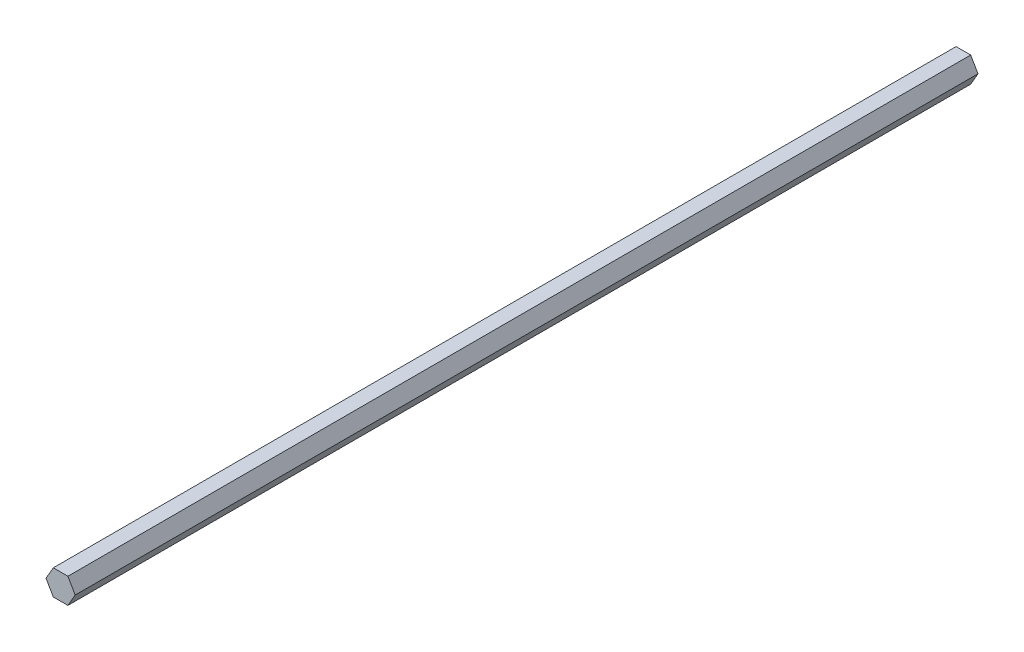
ISO-10303-21;
HEADER;
FILE_DESCRIPTION(('STEP AP214'),'2;1');
FILE_NAME('part.step','',(''),(''),'','','');
FILE_SCHEMA(('AUTOMOTIVE_DESIGN { 1 0 10303 214 1 1 1 1 }'));
ENDSEC;
DATA;
#1=APPLICATION_CONTEXT('core data for automotive mechanical design processes');
#2=APPLICATION_PROTOCOL_DEFINITION('international standard','automotive_design',2000,#1);
#3=PRODUCT_CONTEXT('',#1,'mechanical');
#4=PRODUCT('Part','Part','',(#3));
#5=PRODUCT_RELATED_PRODUCT_CATEGORY('part','',(#4));
#6=PRODUCT_DEFINITION_FORMATION('','',#4);
#7=PRODUCT_DEFINITION_CONTEXT('part definition',#1,'design');
#8=PRODUCT_DEFINITION('design','',#6,#7);
#9=PRODUCT_DEFINITION_SHAPE('','',#8);
#10=(LENGTH_UNIT() NAMED_UNIT(*) SI_UNIT(.MILLI.,.METRE.));
#11=(NAMED_UNIT(*) PLANE_ANGLE_UNIT() SI_UNIT($,.RADIAN.));
#12=(NAMED_UNIT(*) SI_UNIT($,.STERADIAN.) SOLID_ANGLE_UNIT());
#13=UNCERTAINTY_MEASURE_WITH_UNIT(LENGTH_MEASURE(1.E-05),#10,'distance_accuracy_value','');
#14=(GEOMETRIC_REPRESENTATION_CONTEXT(3) GLOBAL_UNCERTAINTY_ASSIGNED_CONTEXT((#13)) GLOBAL_UNIT_ASSIGNED_CONTEXT((#10,
#11,#12)) REPRESENTATION_CONTEXT('',''));
#15=CARTESIAN_POINT('',(0.,0.,0.));
#16=DIRECTION('',(0.,0.,1.));
#17=DIRECTION('',(1.,0.,0.));
#18=AXIS2_PLACEMENT_3D('',#15,#16,#17);
#19=CARTESIAN_POINT('',(3.665,6.34796620973994,453.18));
#20=DIRECTION('',(0.,-1.,0.));
#21=DIRECTION('',(0.,0.,-1.));
#22=AXIS2_PLACEMENT_3D('',#19,#20,#21);
#23=PLANE('',#22);
#24=DIRECTION('',(-1.,0.,0.));
#25=VECTOR('',#24,1.);
#26=CARTESIAN_POINT('',(3.665,6.34796620973994,0.));
#27=LINE('',#26,#25);
#28=CARTESIAN_POINT('',(3.665,6.34796620973994,0.));
#29=VERTEX_POINT('',#28);
#30=CARTESIAN_POINT('',(-3.665,6.34796620973994,0.));
#31=VERTEX_POINT('',#30);
#32=EDGE_CURVE('E118',#29,#31,#27,.T.);
#33=ORIENTED_EDGE('',*,*,#32,.T.);
#34=DIRECTION('',(0.,0.,-1.));
#35=VECTOR('',#34,1.);
#36=CARTESIAN_POINT('',(-3.665,6.34796620973994,453.18));
#37=LINE('',#36,#35);
#38=CARTESIAN_POINT('',(-3.665,6.34796620973994,453.18));
#39=VERTEX_POINT('',#38);
#40=EDGE_CURVE('E11',#39,#31,#37,.T.);
#41=ORIENTED_EDGE('',*,*,#40,.F.);
#42=DIRECTION('',(-1.,0.,0.));
#43=VECTOR('',#42,1.);
#44=CARTESIAN_POINT('',(3.665,6.34796620973994,453.18));
#45=LINE('',#44,#43);
#46=CARTESIAN_POINT('',(3.665,6.34796620973994,453.18));
#47=VERTEX_POINT('',#46);
#48=EDGE_CURVE('E128',#47,#39,#45,.T.);
#49=ORIENTED_EDGE('',*,*,#48,.F.);
#50=DIRECTION('',(0.,0.,-1.));
#51=VECTOR('',#50,1.);
#52=CARTESIAN_POINT('',(3.665,6.34796620973994,453.18));
#53=LINE('',#52,#51);
#54=EDGE_CURVE('E114',#47,#29,#53,.T.);
#55=ORIENTED_EDGE('',*,*,#54,.T.);
#56=EDGE_LOOP('',(#33,#41,#49,#55));
#57=FACE_BOUND('',#56,.T.);
#58=ADVANCED_FACE('F34',(#57),#23,.F.);
#59=CARTESIAN_POINT('',(-3.665,6.34796620973994,453.18));
#60=DIRECTION('',(0.866025403784439,-0.5,0.));
#61=DIRECTION('',(0.5,0.866025403784439,0.));
#62=AXIS2_PLACEMENT_3D('',#59,#60,#61);
#63=PLANE('',#62);
#64=DIRECTION('',(-0.5,-0.866025403784439,0.));
#65=VECTOR('',#64,1.);
#66=CARTESIAN_POINT('',(-3.665,6.34796620973994,0.));
#67=LINE('',#66,#65);
#68=CARTESIAN_POINT('',(-7.33,0.,0.));
#69=VERTEX_POINT('',#68);
#70=EDGE_CURVE('E121',#31,#69,#67,.T.);
#71=ORIENTED_EDGE('',*,*,#70,.T.);
#72=DIRECTION('',(0.,0.,-1.));
#73=VECTOR('',#72,1.);
#74=CARTESIAN_POINT('',(-7.33,0.,453.18));
#75=LINE('',#74,#73);
#76=CARTESIAN_POINT('',(-7.33,0.,453.18));
#77=VERTEX_POINT('',#76);
#78=EDGE_CURVE('E42',#77,#69,#75,.T.);
#79=ORIENTED_EDGE('',*,*,#78,.F.);
#80=DIRECTION('',(-0.5,-0.866025403784439,0.));
#81=VECTOR('',#80,1.);
#82=CARTESIAN_POINT('',(-3.665,6.34796620973994,453.18));
#83=LINE('',#82,#81);
#84=EDGE_CURVE('E87',#39,#77,#83,.T.);
#85=ORIENTED_EDGE('',*,*,#84,.F.);
#86=ORIENTED_EDGE('',*,*,#40,.T.);
#87=EDGE_LOOP('',(#71,#79,#85,#86));
#88=FACE_BOUND('',#87,.T.);
#89=ADVANCED_FACE('F152',(#88),#63,.F.);
#90=CARTESIAN_POINT('',(-7.33,0.,453.18));
#91=DIRECTION('',(0.866025403784439,0.5,0.));
#92=DIRECTION('',(-0.5,0.866025403784439,0.));
#93=AXIS2_PLACEMENT_3D('',#90,#91,#92);
#94=PLANE('',#93);
#95=DIRECTION('',(0.5,-0.866025403784439,0.));
#96=VECTOR('',#95,1.);
#97=CARTESIAN_POINT('',(-7.33,0.,0.));
#98=LINE('',#97,#96);
#99=CARTESIAN_POINT('',(-3.665,-6.34796620973994,0.));
#100=VERTEX_POINT('',#99);
#101=EDGE_CURVE('E123',#69,#100,#98,.T.);
#102=ORIENTED_EDGE('',*,*,#101,.T.);
#103=DIRECTION('',(0.,0.,-1.));
#104=VECTOR('',#103,1.);
#105=CARTESIAN_POINT('',(-3.665,-6.34796620973994,453.18));
#106=LINE('',#105,#104);
#107=CARTESIAN_POINT('',(-3.665,-6.34796620973994,453.18));
#108=VERTEX_POINT('',#107);
#109=EDGE_CURVE('E109',#108,#100,#106,.T.);
#110=ORIENTED_EDGE('',*,*,#109,.F.);
#111=DIRECTION('',(0.5,-0.866025403784439,0.));
#112=VECTOR('',#111,1.);
#113=CARTESIAN_POINT('',(-7.33,0.,453.18));
#114=LINE('',#113,#112);
#115=EDGE_CURVE('E100',#77,#108,#114,.T.);
#116=ORIENTED_EDGE('',*,*,#115,.F.);
#117=ORIENTED_EDGE('',*,*,#78,.T.);
#118=EDGE_LOOP('',(#102,#110,#116,#117));
#119=FACE_BOUND('',#118,.T.);
#120=ADVANCED_FACE('F134',(#119),#94,.F.);
#121=CARTESIAN_POINT('',(-3.665,-6.34796620973994,453.18));
#122=DIRECTION('',(0.,1.,0.));
#123=DIRECTION('',(-1.,0.,0.));
#124=AXIS2_PLACEMENT_3D('',#121,#122,#123);
#125=PLANE('',#124);
#126=DIRECTION('',(1.,0.,0.));
#127=VECTOR('',#126,1.);
#128=CARTESIAN_POINT('',(-3.665,-6.34796620973994,0.));
#129=LINE('',#128,#127);
#130=CARTESIAN_POINT('',(3.665,-6.34796620973994,0.));
#131=VERTEX_POINT('',#130);
#132=EDGE_CURVE('E108',#100,#131,#129,.T.);
#133=ORIENTED_EDGE('',*,*,#132,.T.);
#134=DIRECTION('',(0.,0.,-1.));
#135=VECTOR('',#134,1.);
#136=CARTESIAN_POINT('',(3.665,-6.34796620973994,453.18));
#137=LINE('',#136,#135);
#138=CARTESIAN_POINT('',(3.665,-6.34796620973994,453.18));
#139=VERTEX_POINT('',#138);
#140=EDGE_CURVE('E105',#139,#131,#137,.T.);
#141=ORIENTED_EDGE('',*,*,#140,.F.);
#142=DIRECTION('',(1.,0.,0.));
#143=VECTOR('',#142,1.);
#144=CARTESIAN_POINT('',(-3.665,-6.34796620973994,453.18));
#145=LINE('',#144,#143);
#146=EDGE_CURVE('E94',#108,#139,#145,.T.);
#147=ORIENTED_EDGE('',*,*,#146,.F.);
#148=ORIENTED_EDGE('',*,*,#109,.T.);
#149=EDGE_LOOP('',(#133,#141,#147,#148));
#150=FACE_BOUND('',#149,.T.);
#151=ADVANCED_FACE('F106',(#150),#125,.F.);
#152=CARTESIAN_POINT('',(3.665,-6.34796620973994,453.18));
#153=DIRECTION('',(-0.866025403784439,0.5,0.));
#154=DIRECTION('',(-0.5,-0.866025403784439,0.));
#155=AXIS2_PLACEMENT_3D('',#152,#153,#154);
#156=PLANE('',#155);
#157=DIRECTION('',(0.5,0.866025403784439,0.));
#158=VECTOR('',#157,1.);
#159=CARTESIAN_POINT('',(3.665,-6.34796620973994,0.));
#160=LINE('',#159,#158);
#161=CARTESIAN_POINT('',(7.33,0.,0.));
#162=VERTEX_POINT('',#161);
#163=EDGE_CURVE('E73',#131,#162,#160,.T.);
#164=ORIENTED_EDGE('',*,*,#163,.T.);
#165=DIRECTION('',(0.,0.,-1.));
#166=VECTOR('',#165,1.);
#167=CARTESIAN_POINT('',(7.33,0.,453.18));
#168=LINE('',#167,#166);
#169=CARTESIAN_POINT('',(7.33,0.,453.18));
#170=VERTEX_POINT('',#169);
#171=EDGE_CURVE('E110',#170,#162,#168,.T.);
#172=ORIENTED_EDGE('',*,*,#171,.F.);
#173=DIRECTION('',(0.5,0.866025403784439,0.));
#174=VECTOR('',#173,1.);
#175=CARTESIAN_POINT('',(3.665,-6.34796620973994,453.18));
#176=LINE('',#175,#174);
#177=EDGE_CURVE('E98',#139,#170,#176,.T.);
#178=ORIENTED_EDGE('',*,*,#177,.F.);
#179=ORIENTED_EDGE('',*,*,#140,.T.);
#180=EDGE_LOOP('',(#164,#172,#178,#179));
#181=FACE_BOUND('',#180,.T.);
#182=ADVANCED_FACE('F112',(#181),#156,.F.);
#183=CARTESIAN_POINT('',(7.33,0.,453.18));
#184=DIRECTION('',(-0.866025403784439,-0.5,0.));
#185=DIRECTION('',(0.5,-0.866025403784439,0.));
#186=AXIS2_PLACEMENT_3D('',#183,#184,#185);
#187=PLANE('',#186);
#188=DIRECTION('',(-0.5,0.866025403784439,0.));
#189=VECTOR('',#188,1.);
#190=CARTESIAN_POINT('',(7.33,0.,0.));
#191=LINE('',#190,#189);
#192=EDGE_CURVE('E79',#162,#29,#191,.T.);
#193=ORIENTED_EDGE('',*,*,#192,.T.);
#194=ORIENTED_EDGE('',*,*,#54,.F.);
#195=DIRECTION('',(-0.5,0.866025403784439,0.));
#196=VECTOR('',#195,1.);
#197=CARTESIAN_POINT('',(7.33,0.,453.18));
#198=LINE('',#197,#196);
#199=EDGE_CURVE('E50',#170,#47,#198,.T.);
#200=ORIENTED_EDGE('',*,*,#199,.F.);
#201=ORIENTED_EDGE('',*,*,#171,.T.);
#202=EDGE_LOOP('',(#193,#194,#200,#201));
#203=FACE_BOUND('',#202,.T.);
#204=ADVANCED_FACE('F141',(#203),#187,.F.);
#205=CARTESIAN_POINT('',(0.,0.,453.18));
#206=DIRECTION('',(0.,0.,1.));
#207=DIRECTION('',(1.,0.,0.));
#208=AXIS2_PLACEMENT_3D('',#205,#206,#207);
#209=PLANE('',#208);
#210=ORIENTED_EDGE('',*,*,#48,.T.);
#211=ORIENTED_EDGE('',*,*,#84,.T.);
#212=ORIENTED_EDGE('',*,*,#115,.T.);
#213=ORIENTED_EDGE('',*,*,#146,.T.);
#214=ORIENTED_EDGE('',*,*,#177,.T.);
#215=ORIENTED_EDGE('',*,*,#199,.T.);
#216=EDGE_LOOP('',(#210,#211,#212,#213,#214,#215));
#217=FACE_BOUND('',#216,.T.);
#218=ADVANCED_FACE('F96',(#217),#209,.T.);
#219=CARTESIAN_POINT('',(0.,0.,0.));
#220=DIRECTION('',(0.,0.,1.));
#221=DIRECTION('',(1.,0.,0.));
#222=AXIS2_PLACEMENT_3D('',#219,#220,#221);
#223=PLANE('',#222);
#224=ORIENTED_EDGE('',*,*,#32,.F.);
#225=ORIENTED_EDGE('',*,*,#192,.F.);
#226=ORIENTED_EDGE('',*,*,#163,.F.);
#227=ORIENTED_EDGE('',*,*,#132,.F.);
#228=ORIENTED_EDGE('',*,*,#101,.F.);
#229=ORIENTED_EDGE('',*,*,#70,.F.);
#230=EDGE_LOOP('',(#224,#225,#226,#227,#228,#229));
#231=FACE_BOUND('',#230,.T.);
#232=ADVANCED_FACE('F137',(#231),#223,.F.);
#233=CLOSED_SHELL('',(#58,#89,#120,#151,#182,#204,#218,#232));
#234=MANIFOLD_SOLID_BREP('B2',#233);
#235=ADVANCED_BREP_SHAPE_REPRESENTATION('',(#18,#234),#14);
#236=SHAPE_DEFINITION_REPRESENTATION(#9,#235);
ENDSEC;
END-ISO-10303-21;
